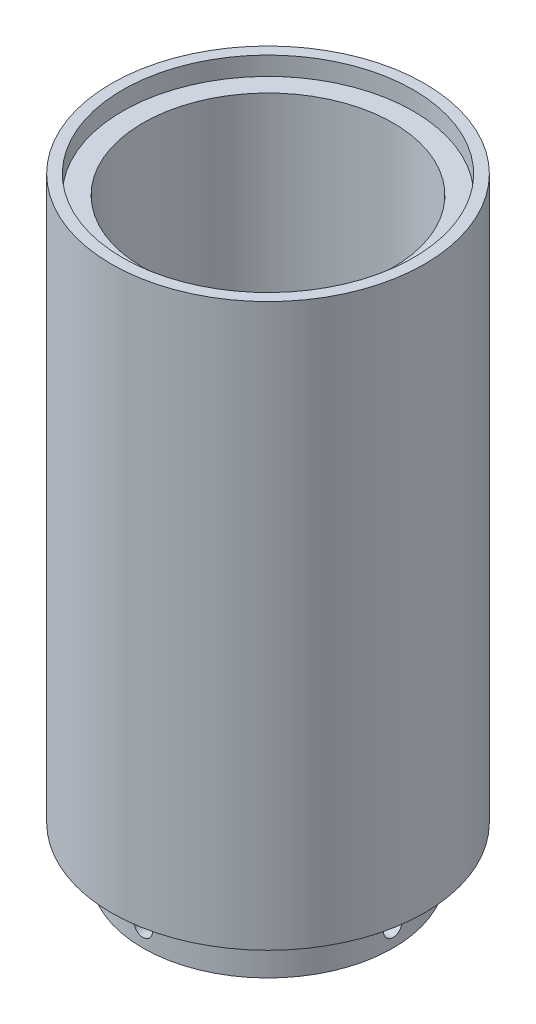
ISO-10303-21;
HEADER;
FILE_DESCRIPTION(('STEP AP214'),'2;1');
FILE_NAME('part.step','',(''),(''),'','','');
FILE_SCHEMA(('AUTOMOTIVE_DESIGN { 1 0 10303 214 1 1 1 1 }'));
ENDSEC;
DATA;
#1=APPLICATION_CONTEXT('core data for automotive mechanical design processes');
#2=APPLICATION_PROTOCOL_DEFINITION('international standard','automotive_design',2000,#1);
#3=PRODUCT_CONTEXT('',#1,'mechanical');
#4=PRODUCT('Part','Part','',(#3));
#5=PRODUCT_RELATED_PRODUCT_CATEGORY('part','',(#4));
#6=PRODUCT_DEFINITION_FORMATION('','',#4);
#7=PRODUCT_DEFINITION_CONTEXT('part definition',#1,'design');
#8=PRODUCT_DEFINITION('design','',#6,#7);
#9=PRODUCT_DEFINITION_SHAPE('','',#8);
#10=(LENGTH_UNIT() NAMED_UNIT(*) SI_UNIT(.MILLI.,.METRE.));
#11=(NAMED_UNIT(*) PLANE_ANGLE_UNIT() SI_UNIT($,.RADIAN.));
#12=(NAMED_UNIT(*) SI_UNIT($,.STERADIAN.) SOLID_ANGLE_UNIT());
#13=UNCERTAINTY_MEASURE_WITH_UNIT(LENGTH_MEASURE(1.E-05),#10,'distance_accuracy_value','');
#14=(GEOMETRIC_REPRESENTATION_CONTEXT(3) GLOBAL_UNCERTAINTY_ASSIGNED_CONTEXT((#13)) GLOBAL_UNIT_ASSIGNED_CONTEXT((#10,
#11,#12)) REPRESENTATION_CONTEXT('',''));
#15=CARTESIAN_POINT('',(0.,0.,0.));
#16=DIRECTION('',(0.,0.,1.));
#17=DIRECTION('',(1.,0.,0.));
#18=AXIS2_PLACEMENT_3D('',#15,#16,#17);
#19=CARTESIAN_POINT('',(-33.85,5.,0.));
#20=DIRECTION('',(1.,0.,0.));
#21=DIRECTION('',(0.,0.,-1.));
#22=AXIS2_PLACEMENT_3D('',#19,#20,#21);
#23=CYLINDRICAL_SURFACE('',#22,2.5);
#24=CARTESIAN_POINT('',(33.7575547100201,5.,-2.5));
#25=CARTESIAN_POINT('',(33.7575559407926,4.85977951455776,-2.49999385194338));
#26=CARTESIAN_POINT('',(33.7584377720636,4.71946223321612,-2.48816326287914));
#27=CARTESIAN_POINT('',(33.7618700012902,4.44270619559234,-2.44114077846731));
#28=CARTESIAN_POINT('',(33.7644223150855,4.30627208053055,-2.40592205910791));
#29=CARTESIAN_POINT('',(33.7709048513496,4.04133103040799,-2.31314400696));
#30=CARTESIAN_POINT('',(33.7748343189373,3.9128197977404,-2.25559691153225));
#31=CARTESIAN_POINT('',(33.7836274573749,3.66731293970991,-2.11981648962236));
#32=CARTESIAN_POINT('',(33.7884909214898,3.55031477464453,-2.04158773946946));
#33=CARTESIAN_POINT('',(33.798615259828,3.33088383982839,-1.86649081372203));
#34=CARTESIAN_POINT('',(33.8038768374291,3.2284778166897,-1.7695891571153));
#35=CARTESIAN_POINT('',(33.8141980676187,3.04136751510481,-1.55996729252435));
#36=CARTESIAN_POINT('',(33.8192577115756,2.95666399270223,-1.44724640927144));
#37=CARTESIAN_POINT('',(33.8286114106644,2.80727689126956,-1.20902977918353));
#38=CARTESIAN_POINT('',(33.832904594379,2.74261603880214,-1.08351974324513));
#39=CARTESIAN_POINT('',(33.8402341297086,2.63529517308435,-0.82338750012399));
#40=CARTESIAN_POINT('',(33.8432704991262,2.59263484819671,-0.688765422043802));
#41=CARTESIAN_POINT('',(33.8477393932711,2.53060185844555,-0.414493318119113));
#42=CARTESIAN_POINT('',(33.8491748597831,2.51118647433421,-0.274853002909852));
#43=CARTESIAN_POINT('',(33.8502901512624,2.49606250227241,0.00571137027027967));
#44=CARTESIAN_POINT('',(33.8499700025794,2.50035355851507,0.146635408942219));
#45=CARTESIAN_POINT('',(33.847612575935,2.53248558251524,0.425477406970875));
#46=CARTESIAN_POINT('',(33.8455786479391,2.56028060688188,0.563400692813364));
#47=CARTESIAN_POINT('',(33.8400263919,2.63856019907294,0.83261878894263));
#48=CARTESIAN_POINT('',(33.8365080523285,2.68904494311254,0.963913547741467));
#49=CARTESIAN_POINT('',(33.8283771771914,2.81132250611129,1.21629445313845));
#50=CARTESIAN_POINT('',(33.8237635797394,2.8831360210458,1.33737053702253));
#51=CARTESIAN_POINT('',(33.8139610310119,3.04601756697136,1.56576733260539));
#52=CARTESIAN_POINT('',(33.808772070612,3.13708590333766,1.67308782610158));
#53=CARTESIAN_POINT('',(33.7983877320154,3.33615120121618,1.87119540038216));
#54=CARTESIAN_POINT('',(33.793192368076,3.44418806251689,1.96194239404015));
#55=CARTESIAN_POINT('',(33.7833933028725,3.67398423201341,2.12401760037824));
#56=CARTESIAN_POINT('',(33.7787896019581,3.79574354831974,2.19534580158095));
#57=CARTESIAN_POINT('',(33.7706940201411,4.04955517099937,2.31655650134055));
#58=CARTESIAN_POINT('',(33.76720223713,4.18160838235601,2.36643711182423));
#59=CARTESIAN_POINT('',(33.761727503433,4.45224672197084,2.44330800866301));
#60=CARTESIAN_POINT('',(33.7597445279015,4.59083174262955,2.47029867194865));
#61=CARTESIAN_POINT('',(33.7575157337999,4.87024954644396,2.50057315623932));
#62=CARTESIAN_POINT('',(33.7572658253697,5.01107625097786,2.5039127916338));
#63=CARTESIAN_POINT('',(33.7585206542776,5.29128765520883,2.48693644153673));
#64=CARTESIAN_POINT('',(33.7600253788062,5.43067236542567,2.46662062874166));
#65=CARTESIAN_POINT('',(33.7646161855545,5.70388410850982,2.4029565224152));
#66=CARTESIAN_POINT('',(33.7677004907986,5.83771720426305,2.35963410852374));
#67=CARTESIAN_POINT('',(33.7751014246228,6.09621417017824,2.25121282441253));
#68=CARTESIAN_POINT('',(33.7794180687841,6.22087792438179,2.18611367885506));
#69=CARTESIAN_POINT('',(33.7888071956161,6.45775335107489,2.03584493757323));
#70=CARTESIAN_POINT('',(33.7938810762433,6.5699413086385,1.95063804758045));
#71=CARTESIAN_POINT('',(33.8042081402516,6.77844124221508,1.76262659329188));
#72=CARTESIAN_POINT('',(33.8094613260631,6.87475300292887,1.65982179038702));
#73=CARTESIAN_POINT('',(33.8195671558252,7.04895615057968,1.43929204282459));
#74=CARTESIAN_POINT('',(33.8244190008386,7.12681134507761,1.32153846704729));
#75=CARTESIAN_POINT('',(33.8331639780947,7.26164334242395,1.07459705828367));
#76=CARTESIAN_POINT('',(33.8370571181356,7.31862031509785,0.945409318314558));
#77=CARTESIAN_POINT('',(33.8434422960862,7.41001595041519,0.679398082274678));
#78=CARTESIAN_POINT('',(33.845935739656,7.44445725052583,0.542582399034353));
#79=CARTESIAN_POINT('',(33.8492462418548,7.48987791327912,0.265091106323645));
#80=CARTESIAN_POINT('',(33.8500633247357,7.50085761534231,0.124415552724093));
#81=CARTESIAN_POINT('',(33.8499290994473,7.49903980747866,-0.156444776391827));
#82=CARTESIAN_POINT('',(33.8489819946479,7.48629881473645,-0.296629923195694));
#83=CARTESIAN_POINT('',(33.8454341715003,7.4375188174272,-0.572864139575915));
#84=CARTESIAN_POINT('',(33.8428334505462,7.40147977614353,-0.708913202633644));
#85=CARTESIAN_POINT('',(33.8362704396231,7.30714033777592,-0.973019204682343));
#86=CARTESIAN_POINT('',(33.832308190141,7.24884060263738,-1.10107638118883));
#87=CARTESIAN_POINT('',(33.8234661791462,7.11164165267048,-1.34559370305734));
#88=CARTESIAN_POINT('',(33.8185864366744,7.03274286532443,-1.46205408901275));
#89=CARTESIAN_POINT('',(33.8084438951753,6.85637418697008,-1.68036037398494));
#90=CARTESIAN_POINT('',(33.8031802567149,6.7588627964103,-1.78217270608345));
#91=CARTESIAN_POINT('',(33.7928701977005,6.54810515344781,-1.96802235262108));
#92=CARTESIAN_POINT('',(33.7878238303269,6.43485507712056,-2.05205533477542));
#93=CARTESIAN_POINT('',(33.7785110461516,6.19565982365068,-2.2000490183882));
#94=CARTESIAN_POINT('',(33.7742458578827,6.06969512505843,-2.2639782146173));
#95=CARTESIAN_POINT('',(33.7669936419609,5.80887697913092,-2.36969925857361));
#96=CARTESIAN_POINT('',(33.7640051320745,5.6740340506582,-2.41151679160401));
#97=CARTESIAN_POINT('',(33.7604204310655,5.44865073122904,-2.46106964704413));
#98=CARTESIAN_POINT('',(33.7593506578097,5.35956363549128,-2.47564938354674));
#99=CARTESIAN_POINT('',(33.7579174022052,5.18033103882832,-2.49511652732068));
#100=CARTESIAN_POINT('',(33.7575539184248,5.09018554004933,-2.50000395424253));
#101=CARTESIAN_POINT('',(33.7575547100201,5.,-2.5));
#102=B_SPLINE_CURVE_WITH_KNOTS('',3,(#24,#25,#26,#27,#28,#29,#30,#31,#32,#33,#34,#35,#36,#37,
#38,#39,#40,#41,#42,#43,#44,#45,#46,#47,#48,#49,#50,#51,#52,#53,#54,#55,#56,#57,#58,#59,#60,#61,
#62,#63,#64,#65,#66,#67,#68,#69,#70,#71,#72,#73,#74,#75,#76,#77,#78,#79,#80,#81,#82,#83,#84,#85,
#86,#87,#88,#89,#90,#91,#92,#93,#94,#95,#96,#97,#98,#99,#100,#101),.UNSPECIFIED.,.T.,.F.,(4,2,2,
2,2,2,2,2,2,2,2,2,2,2,2,2,2,2,2,2,2,2,2,2,2,2,2,2,2,2,2,2,2,2,2,2,2,2,4),(0.,0.420332197533067,
0.841147311540357,1.26173211731476,1.68222393604582,2.10347684353401,2.52474773834081,
2.94649458314949,3.36823545375361,3.789200058889,4.21015834583852,4.63029567934135,
5.05043627581321,5.47098588725581,5.89154216897942,6.3131025747146,6.73466322961075,
7.1562609877191,7.57785180320975,7.99844736813105,8.41903986251568,8.83916024032636,
9.25928593019978,9.68019704685827,10.1011138710781,10.5228493888741,10.9445814761564,
11.3658892733355,11.7871909753846,12.2074901638232,12.6277900146351,13.0480773683573,
13.4683560007498,13.8895828901766,14.310912301827,14.7328987380723,15.15439390444,
15.4247393034809,15.695084154414),.UNSPECIFIED.);
#103=CARTESIAN_POINT('',(33.7575547100201,5.,-2.5));
#104=VERTEX_POINT('',#103);
#105=EDGE_CURVE('E84',#104,#104,#102,.T.);
#106=ORIENTED_EDGE('',*,*,#105,.F.);
#107=EDGE_LOOP('',(#106));
#108=FACE_BOUND('',#107,.T.);
#109=CARTESIAN_POINT('',(0.,5.,0.));
#110=DIRECTION('',(0.707106781186547,0.,-0.707106781186547));
#111=DIRECTION('',(0.707106781186547,0.,0.707106781186547));
#112=AXIS2_PLACEMENT_3D('',#109,#110,#111);
#113=ELLIPSE('',#112,3.53553390593274,2.5);
#114=CARTESIAN_POINT('',(0.,2.5,0.));
#115=VERTEX_POINT('',#114);
#116=CARTESIAN_POINT('',(0.,7.5,0.));
#117=VERTEX_POINT('',#116);
#118=EDGE_CURVE('E55',#115,#117,#113,.F.);
#119=ORIENTED_EDGE('',*,*,#118,.T.);
#120=CARTESIAN_POINT('',(0.,5.,0.));
#121=DIRECTION('',(0.707106781186547,0.,0.707106781186547));
#122=DIRECTION('',(0.707106781186547,0.,-0.707106781186547));
#123=AXIS2_PLACEMENT_3D('',#120,#121,#122);
#124=ELLIPSE('',#123,3.53553390593274,2.5);
#125=EDGE_CURVE('E49',#117,#115,#124,.F.);
#126=ORIENTED_EDGE('',*,*,#125,.T.);
#127=EDGE_LOOP('',(#119,#126));
#128=FACE_BOUND('',#127,.T.);
#129=ADVANCED_FACE('F39',(#108,#128),#23,.F.);
#130=CARTESIAN_POINT('',(0.,12.5,0.));
#131=DIRECTION('',(0.,-1.,0.));
#132=DIRECTION('',(0.,0.,-1.));
#133=AXIS2_PLACEMENT_3D('',#130,#131,#132);
#134=CYLINDRICAL_SURFACE('',#133,33.85);
#135=CARTESIAN_POINT('',(0.,7.5,-33.85));
#136=CARTESIAN_POINT('',(-0.140221073543675,7.49999385247482,-33.8499987816581));
#137=CARTESIAN_POINT('',(-0.280538941043485,7.48816316752878,-33.849119414337));
#138=CARTESIAN_POINT('',(-0.557296196597035,7.44114026762679,-33.845695988396));
#139=CARTESIAN_POINT('',(-0.693730943889846,7.40592123066727,-33.8431500185471));
#140=CARTESIAN_POINT('',(-0.958673330608619,7.3131422493561,-33.8366812468729));
#141=CARTESIAN_POINT('',(-1.08718526228683,7.2555945272335,-33.8327591983949));
#142=CARTESIAN_POINT('',(-1.33269329052843,7.11981262970497,-33.8239787349433));
#143=CARTESIAN_POINT('',(-1.4496919276743,7.04158303217702,-33.8191205272505));
#144=CARTESIAN_POINT('',(-1.66912232524927,6.86648525220051,-33.8090023046887));
#145=CARTESIAN_POINT('',(-1.77152748958865,6.76958377788307,-33.8037415823937));
#146=CARTESIAN_POINT('',(-1.95863613487495,6.55996263789214,-33.7934172289011));
#147=CARTESIAN_POINT('',(-2.04333885714602,6.44724229461325,-33.7883536061582));
#148=CARTESIAN_POINT('',(-2.19272512514113,6.20902613348826,-33.7789888160072));
#149=CARTESIAN_POINT('',(-2.25738579644217,6.08351593371755,-33.7746885221763));
#150=CARTESIAN_POINT('',(-2.36470628196517,5.82338333439878,-33.7673447966541));
#151=CARTESIAN_POINT('',(-2.40736640999977,5.68876106485499,-33.7643013470356));
#152=CARTESIAN_POINT('',(-2.46939898357317,5.41448839161518,-33.7598214481651));
#153=CARTESIAN_POINT('',(-2.48881413279311,5.27484769517074,-33.7583820524208));
#154=CARTESIAN_POINT('',(-2.50393750300158,4.99428257678906,-33.7572637723667));
#155=CARTESIAN_POINT('',(-2.49964608230207,4.85335817428648,-33.7575848614481));
#156=CARTESIAN_POINT('',(-2.46751348484887,4.57451779314522,-33.7599486084571));
#157=CARTESIAN_POINT('',(-2.43971861825628,4.43659644518638,-33.761987880923));
#158=CARTESIAN_POINT('',(-2.36144001473349,4.1673821434897,-33.7675528831697));
#159=CARTESIAN_POINT('',(-2.3109560980519,4.03608924227411,-33.7710786247269));
#160=CARTESIAN_POINT('',(-2.18868024078073,3.78371057477963,-33.7792231716743));
#161=CARTESIAN_POINT('',(-2.11686740995889,3.66263496563913,-33.7838430477925));
#162=CARTESIAN_POINT('',(-1.95398732019881,3.43423882870363,-33.7936542555519));
#163=CARTESIAN_POINT('',(-1.86291975627955,3.32691851882588,-33.7988455962441));
#164=CARTESIAN_POINT('',(-1.6638550018972,3.12881005870077,-33.8092298071281));
#165=CARTESIAN_POINT('',(-1.55581775506869,3.03806215192595,-33.8144226511598));
#166=CARTESIAN_POINT('',(-1.32602049048511,2.87598528759764,-33.824212819522));
#167=CARTESIAN_POINT('',(-1.20426046593054,2.80465633966611,-33.8288101435574));
#168=CARTESIAN_POINT('',(-0.95044866079013,2.68344510437351,-33.8368918669621));
#169=CARTESIAN_POINT('',(-0.818396086536656,2.63356447284764,-33.8403761804004));
#170=CARTESIAN_POINT('',(-0.54775913033345,2.5566933382775,-33.8458382205116));
#171=CARTESIAN_POINT('',(-0.409174854894665,2.52970246211148,-33.8478159717425));
#172=CARTESIAN_POINT('',(-0.129757382763246,2.49942717630426,-33.8500388847591));
#173=CARTESIAN_POINT('',(0.0110697572543282,2.49608715367164,-33.8502881109975));
#174=CARTESIAN_POINT('',(0.291282125815562,2.51306288476797,-33.8490367256572));
#175=CARTESIAN_POINT('',(0.430667364879335,2.53337846578259,-33.8475361268543));
#176=CARTESIAN_POINT('',(0.703881662675673,2.59704264818694,-33.8429565475387));
#177=CARTESIAN_POINT('',(0.837716730082798,2.64036560048394,-33.8398793248132));
#178=CARTESIAN_POINT('',(1.0962174007035,2.74878862267688,-33.8324924289722));
#179=CARTESIAN_POINT('',(1.22088288928952,2.81388896475234,-33.8281827404531));
#180=CARTESIAN_POINT('',(1.45775947463076,2.96415945407157,-33.8188044445834));
#181=CARTESIAN_POINT('',(1.56994704959508,3.04936659131378,-33.813734444848));
#182=CARTESIAN_POINT('',(1.77844609584682,3.23737832135767,-33.8034102993391));
#183=CARTESIAN_POINT('',(1.87475735018529,3.34018315459164,-33.7981561510504));
#184=CARTESIAN_POINT('',(2.04895943647014,3.56071267635529,-33.7880439692143));
#185=CARTESIAN_POINT('',(2.12681408091987,3.67846599155759,-33.7831867258851));
#186=CARTESIAN_POINT('',(2.2616451125155,3.92540673562071,-33.7744288768733));
#187=CARTESIAN_POINT('',(2.31862166940345,4.05459407151058,-33.7705282634132));
#188=CARTESIAN_POINT('',(2.41001702244103,4.32060558930505,-33.7641293287757));
#189=CARTESIAN_POINT('',(2.44445827605101,4.45742202041608,-33.7616296118985));
#190=CARTESIAN_POINT('',(2.48987859227245,4.73491488774207,-33.7583105517566));
#191=CARTESIAN_POINT('',(2.50085799827801,4.87559126743123,-33.7574911838979));
#192=CARTESIAN_POINT('',(2.49903934070828,5.15645106211513,-33.7576258389143));
#193=CARTESIAN_POINT('',(2.48629814872733,5.2966348509321,-33.7585756201484));
#194=CARTESIAN_POINT('',(2.43751823131129,5.57286630241055,-33.7621325535938));
#195=CARTESIAN_POINT('',(2.40147946673928,5.70891395812346,-33.7647397085893));
#196=CARTESIAN_POINT('',(2.30714109736127,5.9730171888965,-33.7713165309058));
#197=CARTESIAN_POINT('',(2.24884216014956,6.10107300350216,-33.7752861573652));
#198=CARTESIAN_POINT('',(2.11164522652959,6.34558793553535,-33.784140644402));
#199=CARTESIAN_POINT('',(2.03274765611426,6.46204729271625,-33.7890254860515));
#200=CARTESIAN_POINT('',(1.85638030066699,6.68035367482848,-33.7991738069937));
#201=CARTESIAN_POINT('',(1.75886873886344,6.78216690938201,-33.8044381211001));
#202=CARTESIAN_POINT('',(1.54811038427311,6.96801829655883,-33.8147447271709));
#203=CARTESIAN_POINT('',(1.43485976954636,7.05205211923857,-33.8197869648153));
#204=CARTESIAN_POINT('',(1.19566409315874,7.20004668964516,-33.8290884449922));
#205=CARTESIAN_POINT('',(1.06969960632888,7.26397608784914,-33.8333464604184));
#206=CARTESIAN_POINT('',(0.808881912687683,7.36969756839633,-33.8405845000634));
#207=CARTESIAN_POINT('',(0.674039223475618,7.41151533306015,-33.8435660061584));
#208=CARTESIAN_POINT('',(0.448655282348315,7.46106885288312,-33.8471418621958));
#209=CARTESIAN_POINT('',(0.359567278657139,7.47564888816715,-33.8482088416537));
#210=CARTESIAN_POINT('',(0.180332862206552,7.49511642895411,-33.8496383016508));
#211=CARTESIAN_POINT('',(0.0901864515732808,7.5000039539241,-33.850000783605));
#212=CARTESIAN_POINT('',(0.,7.5,-33.85));
#213=B_SPLINE_CURVE_WITH_KNOTS('',3,(#135,#136,#137,#138,#139,#140,#141,#142,#143,#144,#145,
#146,#147,#148,#149,#150,#151,#152,#153,#154,#155,#156,#157,#158,#159,#160,#161,#162,#163,#164,
#165,#166,#167,#168,#169,#170,#171,#172,#173,#174,#175,#176,#177,#178,#179,#180,#181,#182,#183,
#184,#185,#186,#187,#188,#189,#190,#191,#192,#193,#194,#195,#196,#197,#198,#199,#200,#201,#202,
#203,#204,#205,#206,#207,#208,#209,#210,#211,#212),.UNSPECIFIED.,.T.,.F.,(4,2,2,2,2,2,2,2,2,2,2,
2,2,2,2,2,2,2,2,2,2,2,2,2,2,2,2,2,2,2,2,2,2,2,2,2,2,2,4),(0.,0.420333963870563,0.84115080544136,
1.2617376253933,1.68223142740533,2.1034820238842,2.52475067025349,2.9464983640654,
3.36824004196118,3.78920573749616,4.2101650703801,4.63029689092797,5.05043203998056,
5.47098004771151,5.8915347171173,6.31309743794145,6.7346603676468,7.15625583666452,
7.57784443319912,7.998441369445,8.4190352348472,8.83916119478909,9.25929240577137,
9.68020263219045,10.101118609845,10.5228531666681,10.9445842946488,11.3658945055756,
11.7871985500475,12.2074937927232,12.6277897414425,13.0480730862551,13.4683477400273,
13.88957698018,14.3109086874297,14.7328941709062,15.1543884421191,15.4247365706653,
15.6950841562256),.UNSPECIFIED.);
#214=CARTESIAN_POINT('',(0.,7.5,-33.85));
#215=VERTEX_POINT('',#214);
#216=EDGE_CURVE('E117',#215,#215,#213,.T.);
#217=ORIENTED_EDGE('',*,*,#216,.T.);
#218=EDGE_LOOP('',(#217));
#219=FACE_BOUND('',#218,.T.);
#220=CARTESIAN_POINT('',(2.5,5.,33.7575547100201));
#221=CARTESIAN_POINT('',(2.49999385194338,4.85977951455776,33.7575559407926));
#222=CARTESIAN_POINT('',(2.48816326287914,4.71946223321612,33.7584377720636));
#223=CARTESIAN_POINT('',(2.44114077846731,4.44270619559234,33.7618700012902));
#224=CARTESIAN_POINT('',(2.40592205910791,4.30627208053055,33.7644223150855));
#225=CARTESIAN_POINT('',(2.31314400696,4.04133103040799,33.7709048513496));
#226=CARTESIAN_POINT('',(2.25559691153225,3.9128197977404,33.7748343189373));
#227=CARTESIAN_POINT('',(2.11981648962236,3.66731293970991,33.7836274573749));
#228=CARTESIAN_POINT('',(2.04158773946946,3.55031477464453,33.7884909214898));
#229=CARTESIAN_POINT('',(1.86649081372203,3.33088383982839,33.798615259828));
#230=CARTESIAN_POINT('',(1.7695891571153,3.2284778166897,33.8038768374291));
#231=CARTESIAN_POINT('',(1.55996729252435,3.04136751510481,33.8141980676187));
#232=CARTESIAN_POINT('',(1.44724640927144,2.95666399270223,33.8192577115756));
#233=CARTESIAN_POINT('',(1.20902977918353,2.80727689126956,33.8286114106644));
#234=CARTESIAN_POINT('',(1.08351974324513,2.74261603880214,33.832904594379));
#235=CARTESIAN_POINT('',(0.82338750012399,2.63529517308435,33.8402341297086));
#236=CARTESIAN_POINT('',(0.688765422043802,2.59263484819671,33.8432704991262));
#237=CARTESIAN_POINT('',(0.414493318119113,2.53060185844555,33.8477393932711));
#238=CARTESIAN_POINT('',(0.274853002909852,2.51118647433421,33.8491748597831));
#239=CARTESIAN_POINT('',(-0.00571137027027984,2.49606250227241,33.8502901512624));
#240=CARTESIAN_POINT('',(-0.146635408942219,2.50035355851507,33.8499700025794));
#241=CARTESIAN_POINT('',(-0.425477406970875,2.53248558251524,33.847612575935));
#242=CARTESIAN_POINT('',(-0.563400692813365,2.56028060688188,33.8455786479391));
#243=CARTESIAN_POINT('',(-0.832618788942631,2.63856019907294,33.8400263919));
#244=CARTESIAN_POINT('',(-0.963913547741468,2.68904494311254,33.8365080523285));
#245=CARTESIAN_POINT('',(-1.21629445313845,2.81132250611129,33.8283771771914));
#246=CARTESIAN_POINT('',(-1.33737053702253,2.8831360210458,33.8237635797394));
#247=CARTESIAN_POINT('',(-1.56576733260539,3.04601756697137,33.8139610310119));
#248=CARTESIAN_POINT('',(-1.67308782610158,3.13708590333766,33.808772070612));
#249=CARTESIAN_POINT('',(-1.87119540038216,3.33615120121618,33.7983877320154));
#250=CARTESIAN_POINT('',(-1.96194239404015,3.44418806251689,33.793192368076));
#251=CARTESIAN_POINT('',(-2.12401760037824,3.67398423201341,33.7833933028725));
#252=CARTESIAN_POINT('',(-2.19534580158095,3.79574354831974,33.7787896019581));
#253=CARTESIAN_POINT('',(-2.31655650134055,4.04955517099937,33.7706940201411));
#254=CARTESIAN_POINT('',(-2.36643711182423,4.18160838235601,33.76720223713));
#255=CARTESIAN_POINT('',(-2.44330800866301,4.45224672197084,33.761727503433));
#256=CARTESIAN_POINT('',(-2.47029867194865,4.59083174262955,33.7597445279015));
#257=CARTESIAN_POINT('',(-2.50057315623932,4.87024954644396,33.7575157337999));
#258=CARTESIAN_POINT('',(-2.5039127916338,5.01107625097786,33.7572658253697));
#259=CARTESIAN_POINT('',(-2.48693644153673,5.29128765520883,33.7585206542776));
#260=CARTESIAN_POINT('',(-2.46662062874166,5.43067236542567,33.7600253788062));
#261=CARTESIAN_POINT('',(-2.4029565224152,5.70388410850982,33.7646161855545));
#262=CARTESIAN_POINT('',(-2.35963410852374,5.83771720426305,33.7677004907986));
#263=CARTESIAN_POINT('',(-2.25121282441253,6.09621417017824,33.7751014246228));
#264=CARTESIAN_POINT('',(-2.18611367885506,6.22087792438179,33.7794180687841));
#265=CARTESIAN_POINT('',(-2.03584493757323,6.45775335107489,33.7888071956161));
#266=CARTESIAN_POINT('',(-1.95063804758045,6.5699413086385,33.7938810762433));
#267=CARTESIAN_POINT('',(-1.76262659329188,6.77844124221508,33.8042081402516));
#268=CARTESIAN_POINT('',(-1.65982179038702,6.87475300292887,33.8094613260631));
#269=CARTESIAN_POINT('',(-1.43929204282459,7.04895615057968,33.8195671558252));
#270=CARTESIAN_POINT('',(-1.32153846704729,7.12681134507761,33.8244190008386));
#271=CARTESIAN_POINT('',(-1.07459705828367,7.26164334242395,33.8331639780947));
#272=CARTESIAN_POINT('',(-0.945409318314558,7.31862031509785,33.8370571181356));
#273=CARTESIAN_POINT('',(-0.679398082274678,7.41001595041519,33.8434422960862));
#274=CARTESIAN_POINT('',(-0.542582399034354,7.44445725052583,33.845935739656));
#275=CARTESIAN_POINT('',(-0.265091106323646,7.48987791327912,33.8492462418548));
#276=CARTESIAN_POINT('',(-0.124415552724094,7.50085761534231,33.8500633247357));
#277=CARTESIAN_POINT('',(0.156444776391826,7.49903980747866,33.8499290994473));
#278=CARTESIAN_POINT('',(0.296629923195692,7.48629881473645,33.8489819946479));
#279=CARTESIAN_POINT('',(0.572864139575914,7.4375188174272,33.8454341715003));
#280=CARTESIAN_POINT('',(0.708913202633643,7.40147977614353,33.8428334505462));
#281=CARTESIAN_POINT('',(0.973019204682342,7.30714033777592,33.8362704396231));
#282=CARTESIAN_POINT('',(1.10107638118883,7.24884060263738,33.832308190141));
#283=CARTESIAN_POINT('',(1.34559370305734,7.11164165267048,33.8234661791462));
#284=CARTESIAN_POINT('',(1.46205408901275,7.03274286532443,33.8185864366744));
#285=CARTESIAN_POINT('',(1.68036037398494,6.85637418697008,33.8084438951753));
#286=CARTESIAN_POINT('',(1.78217270608345,6.7588627964103,33.8031802567149));
#287=CARTESIAN_POINT('',(1.96802235262108,6.54810515344781,33.7928701977005));
#288=CARTESIAN_POINT('',(2.05205533477542,6.43485507712056,33.7878238303269));
#289=CARTESIAN_POINT('',(2.2000490183882,6.19565982365068,33.7785110461516));
#290=CARTESIAN_POINT('',(2.2639782146173,6.06969512505843,33.7742458578827));
#291=CARTESIAN_POINT('',(2.36969925857361,5.80887697913092,33.7669936419609));
#292=CARTESIAN_POINT('',(2.41151679160401,5.6740340506582,33.7640051320745));
#293=CARTESIAN_POINT('',(2.46106964704413,5.44865073122904,33.7604204310655));
#294=CARTESIAN_POINT('',(2.47564938354674,5.35956363549128,33.7593506578097));
#295=CARTESIAN_POINT('',(2.49511652732068,5.18033103882832,33.7579174022052));
#296=CARTESIAN_POINT('',(2.50000395424253,5.09018554004933,33.7575539184248));
#297=CARTESIAN_POINT('',(2.5,5.,33.7575547100201));
#298=B_SPLINE_CURVE_WITH_KNOTS('',3,(#220,#221,#222,#223,#224,#225,#226,#227,#228,#229,#230,
#231,#232,#233,#234,#235,#236,#237,#238,#239,#240,#241,#242,#243,#244,#245,#246,#247,#248,#249,
#250,#251,#252,#253,#254,#255,#256,#257,#258,#259,#260,#261,#262,#263,#264,#265,#266,#267,#268,
#269,#270,#271,#272,#273,#274,#275,#276,#277,#278,#279,#280,#281,#282,#283,#284,#285,#286,#287,
#288,#289,#290,#291,#292,#293,#294,#295,#296,#297),.UNSPECIFIED.,.T.,.F.,(4,2,2,2,2,2,2,2,2,2,2,
2,2,2,2,2,2,2,2,2,2,2,2,2,2,2,2,2,2,2,2,2,2,2,2,2,2,2,4),(0.,0.420332197533067,
0.841147311540357,1.26173211731476,1.68222393604582,2.10347684353401,2.52474773834081,
2.94649458314949,3.36823545375361,3.789200058889,4.21015834583852,4.63029567934135,
5.05043627581321,5.47098588725581,5.89154216897942,6.3131025747146,6.73466322961075,
7.1562609877191,7.57785180320975,7.99844736813105,8.41903986251568,8.83916024032636,
9.25928593019978,9.68019704685827,10.1011138710781,10.5228493888741,10.9445814761564,
11.3658892733355,11.7871909753846,12.2074901638232,12.6277900146351,13.0480773683573,
13.4683560007497,13.8895828901766,14.310912301827,14.7328987380723,15.15439390444,
15.4247393034809,15.695084154414),.UNSPECIFIED.);
#299=CARTESIAN_POINT('',(2.5,5.,33.7575547100201));
#300=VERTEX_POINT('',#299);
#301=EDGE_CURVE('E124',#300,#300,#298,.T.);
#302=ORIENTED_EDGE('',*,*,#301,.T.);
#303=EDGE_LOOP('',(#302));
#304=FACE_BOUND('',#303,.T.);
#305=CARTESIAN_POINT('',(-33.85,2.5,0.));
#306=CARTESIAN_POINT('',(-33.8499987816581,2.50000614752518,-0.140221073543675));
#307=CARTESIAN_POINT('',(-33.849119414337,2.51183683247122,-0.280538941043485));
#308=CARTESIAN_POINT('',(-33.845695988396,2.55885973237322,-0.557296196597035));
#309=CARTESIAN_POINT('',(-33.8431500185471,2.59407876933273,-0.693730943889846));
#310=CARTESIAN_POINT('',(-33.8366812468729,2.6868577506439,-0.958673330608618));
#311=CARTESIAN_POINT('',(-33.8327591983949,2.7444054727665,-1.08718526228683));
#312=CARTESIAN_POINT('',(-33.8239787349433,2.88018737029503,-1.33269329052843));
#313=CARTESIAN_POINT('',(-33.8191205272505,2.95841696782298,-1.4496919276743));
#314=CARTESIAN_POINT('',(-33.8090023046887,3.13351474779949,-1.66912232524926));
#315=CARTESIAN_POINT('',(-33.8037415823937,3.23041622211693,-1.77152748958865));
#316=CARTESIAN_POINT('',(-33.7934172289011,3.44003736210787,-1.95863613487495));
#317=CARTESIAN_POINT('',(-33.7883536061582,3.55275770538676,-2.04333885714602));
#318=CARTESIAN_POINT('',(-33.7789888160072,3.79097386651174,-2.19272512514113));
#319=CARTESIAN_POINT('',(-33.7746885221763,3.91648406628245,-2.25738579644217));
#320=CARTESIAN_POINT('',(-33.7673447966541,4.17661666560122,-2.36470628196517));
#321=CARTESIAN_POINT('',(-33.7643013470356,4.31123893514501,-2.40736640999977));
#322=CARTESIAN_POINT('',(-33.7598214481651,4.58551160838482,-2.46939898357317));
#323=CARTESIAN_POINT('',(-33.7583820524208,4.72515230482926,-2.48881413279311));
#324=CARTESIAN_POINT('',(-33.7572637723667,5.00571742321094,-2.50393750300158));
#325=CARTESIAN_POINT('',(-33.7575848614481,5.14664182571351,-2.49964608230207));
#326=CARTESIAN_POINT('',(-33.7599486084571,5.42548220685478,-2.46751348484887));
#327=CARTESIAN_POINT('',(-33.761987880923,5.56340355481362,-2.43971861825628));
#328=CARTESIAN_POINT('',(-33.7675528831697,5.8326178565103,-2.36144001473349));
#329=CARTESIAN_POINT('',(-33.7710786247269,5.96391075772589,-2.3109560980519));
#330=CARTESIAN_POINT('',(-33.7792231716743,6.21628942522037,-2.18868024078073));
#331=CARTESIAN_POINT('',(-33.7838430477925,6.33736503436087,-2.1168674099589));
#332=CARTESIAN_POINT('',(-33.7936542555519,6.56576117129637,-1.95398732019882));
#333=CARTESIAN_POINT('',(-33.7988455962441,6.67308148117412,-1.86291975627955));
#334=CARTESIAN_POINT('',(-33.8092298071281,6.87118994129923,-1.6638550018972));
#335=CARTESIAN_POINT('',(-33.8144226511598,6.96193784807405,-1.55581775506869));
#336=CARTESIAN_POINT('',(-33.824212819522,7.12401471240237,-1.32602049048511));
#337=CARTESIAN_POINT('',(-33.8288101435574,7.19534366033389,-1.20426046593055));
#338=CARTESIAN_POINT('',(-33.8368918669621,7.31655489562649,-0.950448660790131));
#339=CARTESIAN_POINT('',(-33.8403761804004,7.36643552715236,-0.818396086536657));
#340=CARTESIAN_POINT('',(-33.8458382205116,7.4433066617225,-0.547759130333451));
#341=CARTESIAN_POINT('',(-33.8478159717425,7.47029753788852,-0.409174854894666));
#342=CARTESIAN_POINT('',(-33.8500388847591,7.50057282369574,-0.129757382763248));
#343=CARTESIAN_POINT('',(-33.8502881109975,7.50391284632836,0.0110697572543261));
#344=CARTESIAN_POINT('',(-33.8490367256572,7.48693711523204,0.29128212581556));
#345=CARTESIAN_POINT('',(-33.8475361268543,7.46662153421742,0.430667364879333));
#346=CARTESIAN_POINT('',(-33.8429565475387,7.40295735181307,0.70388166267567));
#347=CARTESIAN_POINT('',(-33.8398793248132,7.35963439951607,0.837716730082796));
#348=CARTESIAN_POINT('',(-33.8324924289722,7.25121137732312,1.09621740070349));
#349=CARTESIAN_POINT('',(-33.8281827404531,7.18611103524766,1.22088288928951));
#350=CARTESIAN_POINT('',(-33.8188044445834,7.03584054592843,1.45775947463075));
#351=CARTESIAN_POINT('',(-33.813734444848,6.95063340868622,1.56994704959508));
#352=CARTESIAN_POINT('',(-33.8034102993391,6.76262167864234,1.77844609584681));
#353=CARTESIAN_POINT('',(-33.7981561510504,6.65981684540837,1.87475735018529));
#354=CARTESIAN_POINT('',(-33.7880439692143,6.43928732364472,2.04895943647014));
#355=CARTESIAN_POINT('',(-33.7831867258851,6.32153400844241,2.12681408091987));
#356=CARTESIAN_POINT('',(-33.7744288768733,6.0745932643793,2.2616451125155));
#357=CARTESIAN_POINT('',(-33.7705282634132,5.94540592848942,2.31862166940345));
#358=CARTESIAN_POINT('',(-33.7641293287757,5.67939441069495,2.41001702244103));
#359=CARTESIAN_POINT('',(-33.7616296118985,5.54257797958392,2.44445827605101));
#360=CARTESIAN_POINT('',(-33.7583105517566,5.26508511225793,2.48987859227245));
#361=CARTESIAN_POINT('',(-33.7574911838979,5.12440873256877,2.50085799827801));
#362=CARTESIAN_POINT('',(-33.7576258389143,4.84354893788487,2.49903934070828));
#363=CARTESIAN_POINT('',(-33.7585756201484,4.7033651490679,2.48629814872733));
#364=CARTESIAN_POINT('',(-33.7621325535938,4.42713369758946,2.43751823131129));
#365=CARTESIAN_POINT('',(-33.7647397085893,4.29108604187654,2.40147946673928));
#366=CARTESIAN_POINT('',(-33.7713165309058,4.0269828111035,2.30714109736127));
#367=CARTESIAN_POINT('',(-33.7752861573652,3.89892699649785,2.24884216014956));
#368=CARTESIAN_POINT('',(-33.784140644402,3.65441206446466,2.11164522652959));
#369=CARTESIAN_POINT('',(-33.7890254860515,3.53795270728375,2.03274765611426));
#370=CARTESIAN_POINT('',(-33.7991738069937,3.31964632517152,1.85638030066699));
#371=CARTESIAN_POINT('',(-33.8044381211001,3.21783309061799,1.75886873886344));
#372=CARTESIAN_POINT('',(-33.8147447271709,3.03198170344117,1.54811038427312));
#373=CARTESIAN_POINT('',(-33.8197869648153,2.94794788076143,1.43485976954636));
#374=CARTESIAN_POINT('',(-33.8290884449922,2.79995331035484,1.19566409315874));
#375=CARTESIAN_POINT('',(-33.8333464604184,2.73602391215086,1.06969960632888));
#376=CARTESIAN_POINT('',(-33.8405845000634,2.63030243160367,0.808881912687684));
#377=CARTESIAN_POINT('',(-33.8435660061584,2.58848466693985,0.674039223475619));
#378=CARTESIAN_POINT('',(-33.8471418621958,2.53893114711689,0.448655282348316));
#379=CARTESIAN_POINT('',(-33.8482088416537,2.52435111183285,0.35956727865714));
#380=CARTESIAN_POINT('',(-33.8496383016508,2.5048835710459,0.180332862206553));
#381=CARTESIAN_POINT('',(-33.850000783605,2.4999960460759,0.0901864515732813));
#382=CARTESIAN_POINT('',(-33.85,2.5,0.));
#383=B_SPLINE_CURVE_WITH_KNOTS('',3,(#305,#306,#307,#308,#309,#310,#311,#312,#313,#314,#315,
#316,#317,#318,#319,#320,#321,#322,#323,#324,#325,#326,#327,#328,#329,#330,#331,#332,#333,#334,
#335,#336,#337,#338,#339,#340,#341,#342,#343,#344,#345,#346,#347,#348,#349,#350,#351,#352,#353,
#354,#355,#356,#357,#358,#359,#360,#361,#362,#363,#364,#365,#366,#367,#368,#369,#370,#371,#372,
#373,#374,#375,#376,#377,#378,#379,#380,#381,#382),.UNSPECIFIED.,.T.,.F.,(4,2,2,2,2,2,2,2,2,2,2,
2,2,2,2,2,2,2,2,2,2,2,2,2,2,2,2,2,2,2,2,2,2,2,2,2,2,2,4),(0.,0.420333963870563,0.84115080544136,
1.2617376253933,1.68223142740533,2.1034820238842,2.52475067025349,2.9464983640654,
3.36824004196118,3.78920573749615,4.2101650703801,4.63029689092797,5.05043203998056,
5.47098004771151,5.8915347171173,6.31309743794145,6.7346603676468,7.15625583666452,
7.57784443319911,7.99844136944499,8.4190352348472,8.83916119478908,9.25929240577137,
9.68020263219045,10.101118609845,10.5228531666681,10.9445842946488,11.3658945055756,
11.7871985500475,12.2074937927232,12.6277897414425,13.0480730862551,13.4683477400273,
13.88957698018,14.3109086874297,14.7328941709062,15.1543884421191,15.4247365706653,
15.6950841562256),.UNSPECIFIED.);
#384=CARTESIAN_POINT('',(-33.85,2.5,0.));
#385=VERTEX_POINT('',#384);
#386=EDGE_CURVE('E71',#385,#385,#383,.T.);
#387=ORIENTED_EDGE('',*,*,#386,.T.);
#388=EDGE_LOOP('',(#387));
#389=FACE_BOUND('',#388,.T.);
#390=ORIENTED_EDGE('',*,*,#105,.T.);
#391=EDGE_LOOP('',(#390));
#392=FACE_BOUND('',#391,.T.);
#393=CARTESIAN_POINT('',(0.,12.5,0.));
#394=DIRECTION('',(0.,1.,0.));
#395=DIRECTION('',(0.,0.,1.));
#396=AXIS2_PLACEMENT_3D('',#393,#394,#395);
#397=CIRCLE('',#396,33.85);
#398=CARTESIAN_POINT('',(0.,12.5,33.85));
#399=VERTEX_POINT('',#398);
#400=EDGE_CURVE('E110',#399,#399,#397,.T.);
#401=ORIENTED_EDGE('',*,*,#400,.F.);
#402=EDGE_LOOP('',(#401));
#403=FACE_BOUND('',#402,.T.);
#404=CARTESIAN_POINT('',(0.,0.,0.));
#405=DIRECTION('',(0.,1.,0.));
#406=DIRECTION('',(0.,0.,1.));
#407=AXIS2_PLACEMENT_3D('',#404,#405,#406);
#408=CIRCLE('',#407,33.85);
#409=CARTESIAN_POINT('',(0.,0.,33.85));
#410=VERTEX_POINT('',#409);
#411=EDGE_CURVE('E112',#410,#410,#408,.T.);
#412=ORIENTED_EDGE('',*,*,#411,.T.);
#413=EDGE_LOOP('',(#412));
#414=FACE_BOUND('',#413,.T.);
#415=ADVANCED_FACE('F41',(#219,#304,#389,#392,#403,#414),#134,.T.);
#416=CARTESIAN_POINT('',(0.,0.,0.));
#417=DIRECTION('',(0.,1.,0.));
#418=DIRECTION('',(0.,0.,1.));
#419=AXIS2_PLACEMENT_3D('',#416,#417,#418);
#420=PLANE('',#419);
#421=ORIENTED_EDGE('',*,*,#411,.F.);
#422=EDGE_LOOP('',(#421));
#423=FACE_BOUND('',#422,.T.);
#424=ADVANCED_FACE('F92',(#423),#420,.F.);
#425=CARTESIAN_POINT('',(0.,5.,0.));
#426=DIRECTION('',(0.707106781186547,0.,-0.707106781186547));
#427=DIRECTION('',(0.707106781186547,0.,0.707106781186547));
#428=AXIS2_PLACEMENT_3D('',#425,#426,#427);
#429=ELLIPSE('',#428,3.53553390593274,2.5);
#430=EDGE_CURVE('E61',#115,#117,#429,.T.);
#431=ORIENTED_EDGE('',*,*,#430,.T.);
#432=CARTESIAN_POINT('',(0.,5.,0.));
#433=DIRECTION('',(0.707106781186547,0.,0.707106781186547));
#434=DIRECTION('',(0.707106781186547,0.,-0.707106781186547));
#435=AXIS2_PLACEMENT_3D('',#432,#433,#434);
#436=ELLIPSE('',#435,3.53553390593274,2.5);
#437=EDGE_CURVE('E66',#117,#115,#436,.T.);
#438=ORIENTED_EDGE('',*,*,#437,.T.);
#439=EDGE_LOOP('',(#431,#438));
#440=FACE_BOUND('',#439,.T.);
#441=ORIENTED_EDGE('',*,*,#386,.F.);
#442=EDGE_LOOP('',(#441));
#443=FACE_BOUND('',#442,.T.);
#444=ADVANCED_FACE('F74',(#440,#443),#23,.F.);
#445=CARTESIAN_POINT('',(0.,5.,-33.85));
#446=DIRECTION('',(0.,0.,1.));
#447=DIRECTION('',(1.,0.,0.));
#448=AXIS2_PLACEMENT_3D('',#445,#446,#447);
#449=CYLINDRICAL_SURFACE('',#448,2.5);
#450=ORIENTED_EDGE('',*,*,#118,.F.);
#451=ORIENTED_EDGE('',*,*,#437,.F.);
#452=EDGE_LOOP('',(#450,#451));
#453=FACE_BOUND('',#452,.T.);
#454=ORIENTED_EDGE('',*,*,#301,.F.);
#455=EDGE_LOOP('',(#454));
#456=FACE_BOUND('',#455,.T.);
#457=ADVANCED_FACE('F69',(#453,#456),#449,.F.);
#458=ORIENTED_EDGE('',*,*,#430,.F.);
#459=ORIENTED_EDGE('',*,*,#125,.F.);
#460=EDGE_LOOP('',(#458,#459));
#461=FACE_BOUND('',#460,.T.);
#462=ORIENTED_EDGE('',*,*,#216,.F.);
#463=EDGE_LOOP('',(#462));
#464=FACE_BOUND('',#463,.T.);
#465=ADVANCED_FACE('F62',(#461,#464),#449,.F.);
#466=CARTESIAN_POINT('',(0.,14.5,0.));
#467=DIRECTION('',(0.,-1.,0.));
#468=DIRECTION('',(0.,0.,-1.));
#469=AXIS2_PLACEMENT_3D('',#466,#467,#468);
#470=CYLINDRICAL_SURFACE('',#469,42.35);
#471=CARTESIAN_POINT('',(0.,12.5,0.));
#472=DIRECTION('',(0.,1.,0.));
#473=DIRECTION('',(0.,0.,1.));
#474=AXIS2_PLACEMENT_3D('',#471,#472,#473);
#475=CIRCLE('',#474,42.35);
#476=CARTESIAN_POINT('',(0.,12.5,42.35));
#477=VERTEX_POINT('',#476);
#478=EDGE_CURVE('E130',#477,#477,#475,.T.);
#479=ORIENTED_EDGE('',*,*,#478,.T.);
#480=EDGE_LOOP('',(#479));
#481=FACE_BOUND('',#480,.T.);
#482=CARTESIAN_POINT('',(0.,164.5,0.));
#483=DIRECTION('',(0.,1.,0.));
#484=DIRECTION('',(0.,0.,1.));
#485=AXIS2_PLACEMENT_3D('',#482,#483,#484);
#486=CIRCLE('',#485,42.35);
#487=CARTESIAN_POINT('',(0.,164.5,42.35));
#488=VERTEX_POINT('',#487);
#489=EDGE_CURVE('E133',#488,#488,#486,.T.);
#490=ORIENTED_EDGE('',*,*,#489,.F.);
#491=EDGE_LOOP('',(#490));
#492=FACE_BOUND('',#491,.T.);
#493=ADVANCED_FACE('F171',(#481,#492),#470,.T.);
#494=CARTESIAN_POINT('',(0.,12.5,0.));
#495=DIRECTION('',(0.,1.,0.));
#496=DIRECTION('',(0.,0.,1.));
#497=AXIS2_PLACEMENT_3D('',#494,#495,#496);
#498=PLANE('',#497);
#499=ORIENTED_EDGE('',*,*,#400,.T.);
#500=EDGE_LOOP('',(#499));
#501=FACE_BOUND('',#500,.T.);
#502=ORIENTED_EDGE('',*,*,#478,.F.);
#503=EDGE_LOOP('',(#502));
#504=FACE_BOUND('',#503,.T.);
#505=ADVANCED_FACE('F167',(#501,#504),#498,.F.);
#506=CARTESIAN_POINT('',(0.,164.5,0.));
#507=DIRECTION('',(0.,1.,0.));
#508=DIRECTION('',(0.,0.,1.));
#509=AXIS2_PLACEMENT_3D('',#506,#507,#508);
#510=PLANE('',#509);
#511=CARTESIAN_POINT('',(0.,164.5,0.));
#512=DIRECTION('',(0.,1.,0.));
#513=DIRECTION('',(0.,0.,1.));
#514=AXIS2_PLACEMENT_3D('',#511,#512,#513);
#515=CIRCLE('',#514,39.35);
#516=CARTESIAN_POINT('',(0.,164.5,39.35));
#517=VERTEX_POINT('',#516);
#518=EDGE_CURVE('E136',#517,#517,#515,.T.);
#519=ORIENTED_EDGE('',*,*,#518,.F.);
#520=EDGE_LOOP('',(#519));
#521=FACE_BOUND('',#520,.T.);
#522=ORIENTED_EDGE('',*,*,#489,.T.);
#523=EDGE_LOOP('',(#522));
#524=FACE_BOUND('',#523,.T.);
#525=ADVANCED_FACE('F160',(#521,#524),#510,.T.);
#526=CARTESIAN_POINT('',(0.,159.5,0.));
#527=DIRECTION('',(0.,1.,0.));
#528=DIRECTION('',(0.,0.,1.));
#529=AXIS2_PLACEMENT_3D('',#526,#527,#528);
#530=CYLINDRICAL_SURFACE('',#529,39.35);
#531=CARTESIAN_POINT('',(0.,159.5,0.));
#532=DIRECTION('',(0.,1.,0.));
#533=DIRECTION('',(0.,0.,1.));
#534=AXIS2_PLACEMENT_3D('',#531,#532,#533);
#535=CIRCLE('',#534,39.35);
#536=CARTESIAN_POINT('',(0.,159.5,39.35));
#537=VERTEX_POINT('',#536);
#538=EDGE_CURVE('E139',#537,#537,#535,.T.);
#539=ORIENTED_EDGE('',*,*,#538,.F.);
#540=EDGE_LOOP('',(#539));
#541=FACE_BOUND('',#540,.T.);
#542=ORIENTED_EDGE('',*,*,#518,.T.);
#543=EDGE_LOOP('',(#542));
#544=FACE_BOUND('',#543,.T.);
#545=ADVANCED_FACE('F151',(#541,#544),#530,.F.);
#546=CARTESIAN_POINT('',(0.,159.5,0.));
#547=DIRECTION('',(0.,1.,0.));
#548=DIRECTION('',(0.,0.,1.));
#549=AXIS2_PLACEMENT_3D('',#546,#547,#548);
#550=PLANE('',#549);
#551=CARTESIAN_POINT('',(0.,159.5,0.));
#552=DIRECTION('',(0.,1.,0.));
#553=DIRECTION('',(0.,0.,1.));
#554=AXIS2_PLACEMENT_3D('',#551,#552,#553);
#555=CIRCLE('',#554,33.85);
#556=CARTESIAN_POINT('',(0.,159.5,33.85));
#557=VERTEX_POINT('',#556);
#558=EDGE_CURVE('E44',#557,#557,#555,.T.);
#559=ORIENTED_EDGE('',*,*,#558,.F.);
#560=EDGE_LOOP('',(#559));
#561=FACE_BOUND('',#560,.T.);
#562=ORIENTED_EDGE('',*,*,#538,.T.);
#563=EDGE_LOOP('',(#562));
#564=FACE_BOUND('',#563,.T.);
#565=ADVANCED_FACE('F148',(#561,#564),#550,.T.);
#566=CARTESIAN_POINT('',(0.,14.5,0.));
#567=DIRECTION('',(0.,1.,0.));
#568=DIRECTION('',(0.,0.,1.));
#569=AXIS2_PLACEMENT_3D('',#566,#567,#568);
#570=PLANE('',#569);
#571=CARTESIAN_POINT('',(0.,14.5,0.));
#572=DIRECTION('',(0.,1.,0.));
#573=DIRECTION('',(0.,0.,1.));
#574=AXIS2_PLACEMENT_3D('',#571,#572,#573);
#575=CIRCLE('',#574,33.85);
#576=CARTESIAN_POINT('',(0.,14.5,33.85));
#577=VERTEX_POINT('',#576);
#578=EDGE_CURVE('E11',#577,#577,#575,.F.);
#579=ORIENTED_EDGE('',*,*,#578,.F.);
#580=EDGE_LOOP('',(#579));
#581=FACE_BOUND('',#580,.T.);
#582=ADVANCED_FACE('F150',(#581),#570,.T.);
#583=CARTESIAN_POINT('',(0.,164.5,0.));
#584=DIRECTION('',(0.,-1.,0.));
#585=DIRECTION('',(0.,0.,-1.));
#586=AXIS2_PLACEMENT_3D('',#583,#584,#585);
#587=CYLINDRICAL_SURFACE('',#586,33.85);
#588=ORIENTED_EDGE('',*,*,#578,.T.);
#589=EDGE_LOOP('',(#588));
#590=FACE_BOUND('',#589,.T.);
#591=ORIENTED_EDGE('',*,*,#558,.T.);
#592=EDGE_LOOP('',(#591));
#593=FACE_BOUND('',#592,.T.);
#594=ADVANCED_FACE('F146',(#590,#593),#587,.F.);
#595=CLOSED_SHELL('',(#129,#415,#424,#444,#457,#465,#493,#505,#525,#545,#565,#582,#594));
#596=MANIFOLD_SOLID_BREP('B2',#595);
#597=ADVANCED_BREP_SHAPE_REPRESENTATION('',(#18,#596),#14);
#598=SHAPE_DEFINITION_REPRESENTATION(#9,#597);
ENDSEC;
END-ISO-10303-21;
